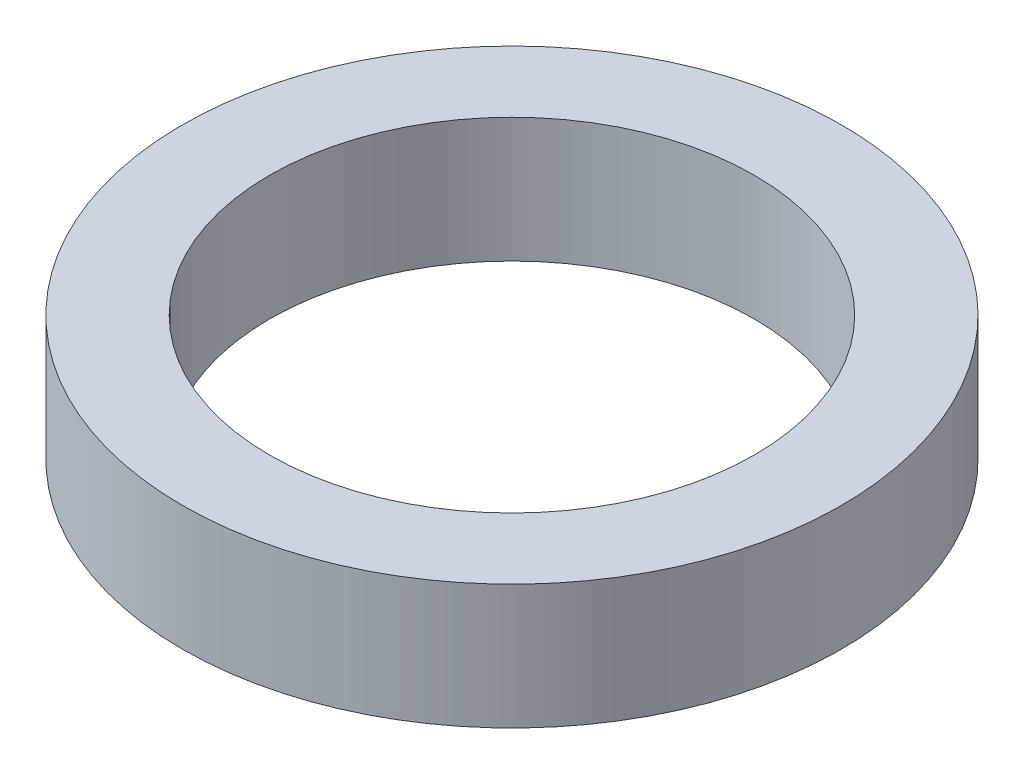
ISO-10303-21;
HEADER;
FILE_DESCRIPTION(('STEP AP214'),'2;1');
FILE_NAME('part.step','',(''),(''),'','','');
FILE_SCHEMA(('AUTOMOTIVE_DESIGN { 1 0 10303 214 1 1 1 1 }'));
ENDSEC;
DATA;
#1=APPLICATION_CONTEXT('core data for automotive mechanical design processes');
#2=APPLICATION_PROTOCOL_DEFINITION('international standard','automotive_design',2000,#1);
#3=PRODUCT_CONTEXT('',#1,'mechanical');
#4=PRODUCT('Part','Part','',(#3));
#5=PRODUCT_RELATED_PRODUCT_CATEGORY('part','',(#4));
#6=PRODUCT_DEFINITION_FORMATION('','',#4);
#7=PRODUCT_DEFINITION_CONTEXT('part definition',#1,'design');
#8=PRODUCT_DEFINITION('design','',#6,#7);
#9=PRODUCT_DEFINITION_SHAPE('','',#8);
#10=(LENGTH_UNIT() NAMED_UNIT(*) SI_UNIT(.MILLI.,.METRE.));
#11=(NAMED_UNIT(*) PLANE_ANGLE_UNIT() SI_UNIT($,.RADIAN.));
#12=(NAMED_UNIT(*) SI_UNIT($,.STERADIAN.) SOLID_ANGLE_UNIT());
#13=UNCERTAINTY_MEASURE_WITH_UNIT(LENGTH_MEASURE(1.E-05),#10,'distance_accuracy_value','');
#14=(GEOMETRIC_REPRESENTATION_CONTEXT(3) GLOBAL_UNCERTAINTY_ASSIGNED_CONTEXT((#13)) GLOBAL_UNIT_ASSIGNED_CONTEXT((#10,
#11,#12)) REPRESENTATION_CONTEXT('',''));
#15=CARTESIAN_POINT('',(0.,0.,0.));
#16=DIRECTION('',(0.,0.,1.));
#17=DIRECTION('',(1.,0.,0.));
#18=AXIS2_PLACEMENT_3D('',#15,#16,#17);
#19=CARTESIAN_POINT('',(0.,120.,0.));
#20=DIRECTION('',(0.,-1.,0.));
#21=DIRECTION('',(0.,0.,-1.));
#22=AXIS2_PLACEMENT_3D('',#19,#20,#21);
#23=CYLINDRICAL_SURFACE('',#22,317.5);
#24=CARTESIAN_POINT('',(0.,120.,0.));
#25=DIRECTION('',(0.,1.,0.));
#26=DIRECTION('',(0.,0.,1.));
#27=AXIS2_PLACEMENT_3D('',#24,#25,#26);
#28=CIRCLE('',#27,317.5);
#29=CARTESIAN_POINT('',(0.,120.,317.5));
#30=VERTEX_POINT('',#29);
#31=EDGE_CURVE('E10',#30,#30,#28,.T.);
#32=ORIENTED_EDGE('',*,*,#31,.F.);
#33=EDGE_LOOP('',(#32));
#34=FACE_BOUND('',#33,.T.);
#35=CARTESIAN_POINT('',(0.,0.,0.));
#36=DIRECTION('',(0.,1.,0.));
#37=DIRECTION('',(0.,0.,1.));
#38=AXIS2_PLACEMENT_3D('',#35,#36,#37);
#39=CIRCLE('',#38,317.5);
#40=CARTESIAN_POINT('',(0.,0.,317.5));
#41=VERTEX_POINT('',#40);
#42=EDGE_CURVE('E39',#41,#41,#39,.T.);
#43=ORIENTED_EDGE('',*,*,#42,.T.);
#44=EDGE_LOOP('',(#43));
#45=FACE_BOUND('',#44,.T.);
#46=ADVANCED_FACE('F36',(#34,#45),#23,.T.);
#47=CARTESIAN_POINT('',(0.,120.,0.));
#48=DIRECTION('',(0.,1.,0.));
#49=DIRECTION('',(0.,0.,1.));
#50=AXIS2_PLACEMENT_3D('',#47,#48,#49);
#51=PLANE('',#50);
#52=CARTESIAN_POINT('',(0.,120.,0.));
#53=DIRECTION('',(0.,1.,0.));
#54=DIRECTION('',(0.,0.,1.));
#55=AXIS2_PLACEMENT_3D('',#52,#53,#54);
#56=CIRCLE('',#55,233.5);
#57=CARTESIAN_POINT('',(0.,120.,233.5));
#58=VERTEX_POINT('',#57);
#59=EDGE_CURVE('E48',#58,#58,#56,.T.);
#60=ORIENTED_EDGE('',*,*,#59,.F.);
#61=EDGE_LOOP('',(#60));
#62=FACE_BOUND('',#61,.T.);
#63=ORIENTED_EDGE('',*,*,#31,.T.);
#64=EDGE_LOOP('',(#63));
#65=FACE_BOUND('',#64,.T.);
#66=ADVANCED_FACE('F63',(#62,#65),#51,.T.);
#67=CARTESIAN_POINT('',(0.,0.,0.));
#68=DIRECTION('',(0.,1.,0.));
#69=DIRECTION('',(0.,0.,1.));
#70=AXIS2_PLACEMENT_3D('',#67,#68,#69);
#71=PLANE('',#70);
#72=CARTESIAN_POINT('',(0.,0.,0.));
#73=DIRECTION('',(0.,1.,0.));
#74=DIRECTION('',(0.,0.,1.));
#75=AXIS2_PLACEMENT_3D('',#72,#73,#74);
#76=CIRCLE('',#75,233.5);
#77=CARTESIAN_POINT('',(0.,0.,233.5));
#78=VERTEX_POINT('',#77);
#79=EDGE_CURVE('E46',#78,#78,#76,.T.);
#80=ORIENTED_EDGE('',*,*,#79,.T.);
#81=EDGE_LOOP('',(#80));
#82=FACE_BOUND('',#81,.T.);
#83=ORIENTED_EDGE('',*,*,#42,.F.);
#84=EDGE_LOOP('',(#83));
#85=FACE_BOUND('',#84,.T.);
#86=ADVANCED_FACE('F54',(#82,#85),#71,.F.);
#87=CARTESIAN_POINT('',(0.,0.,0.));
#88=DIRECTION('',(0.,1.,0.));
#89=DIRECTION('',(0.,0.,1.));
#90=AXIS2_PLACEMENT_3D('',#87,#88,#89);
#91=CYLINDRICAL_SURFACE('',#90,233.5);
#92=ORIENTED_EDGE('',*,*,#79,.F.);
#93=EDGE_LOOP('',(#92));
#94=FACE_BOUND('',#93,.T.);
#95=ORIENTED_EDGE('',*,*,#59,.T.);
#96=EDGE_LOOP('',(#95));
#97=FACE_BOUND('',#96,.T.);
#98=ADVANCED_FACE('F57',(#94,#97),#91,.F.);
#99=CLOSED_SHELL('',(#46,#66,#86,#98));
#100=MANIFOLD_SOLID_BREP('B2',#99);
#101=ADVANCED_BREP_SHAPE_REPRESENTATION('',(#18,#100),#14);
#102=SHAPE_DEFINITION_REPRESENTATION(#9,#101);
ENDSEC;
END-ISO-10303-21;
